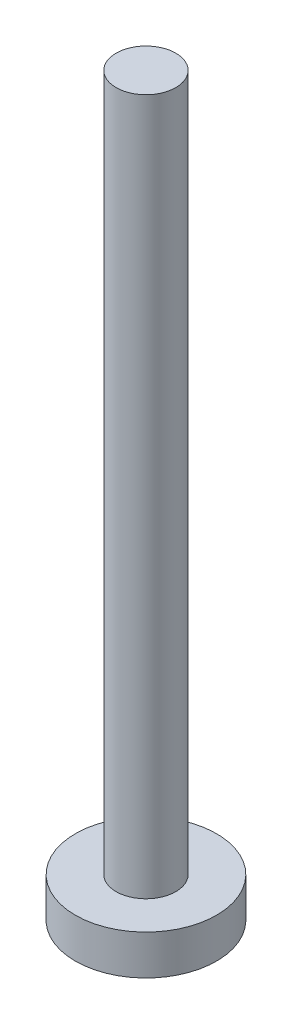
ISO-10303-21;
HEADER;
FILE_DESCRIPTION(('STEP AP214'),'2;1');
FILE_NAME('part.step','',(''),(''),'','','');
FILE_SCHEMA(('AUTOMOTIVE_DESIGN { 1 0 10303 214 1 1 1 1 }'));
ENDSEC;
DATA;
#1=APPLICATION_CONTEXT('core data for automotive mechanical design processes');
#2=APPLICATION_PROTOCOL_DEFINITION('international standard','automotive_design',2000,#1);
#3=PRODUCT_CONTEXT('',#1,'mechanical');
#4=PRODUCT('Part','Part','',(#3));
#5=PRODUCT_RELATED_PRODUCT_CATEGORY('part','',(#4));
#6=PRODUCT_DEFINITION_FORMATION('','',#4);
#7=PRODUCT_DEFINITION_CONTEXT('part definition',#1,'design');
#8=PRODUCT_DEFINITION('design','',#6,#7);
#9=PRODUCT_DEFINITION_SHAPE('','',#8);
#10=(LENGTH_UNIT() NAMED_UNIT(*) SI_UNIT(.MILLI.,.METRE.));
#11=(NAMED_UNIT(*) PLANE_ANGLE_UNIT() SI_UNIT($,.RADIAN.));
#12=(NAMED_UNIT(*) SI_UNIT($,.STERADIAN.) SOLID_ANGLE_UNIT());
#13=UNCERTAINTY_MEASURE_WITH_UNIT(LENGTH_MEASURE(1.E-05),#10,'distance_accuracy_value','');
#14=(GEOMETRIC_REPRESENTATION_CONTEXT(3) GLOBAL_UNCERTAINTY_ASSIGNED_CONTEXT((#13)) GLOBAL_UNIT_ASSIGNED_CONTEXT((#10,
#11,#12)) REPRESENTATION_CONTEXT('',''));
#15=CARTESIAN_POINT('',(0.,0.,0.));
#16=DIRECTION('',(0.,0.,1.));
#17=DIRECTION('',(1.,0.,0.));
#18=AXIS2_PLACEMENT_3D('',#15,#16,#17);
#19=CARTESIAN_POINT('',(0.,2.,0.));
#20=DIRECTION('',(0.,-1.,0.));
#21=DIRECTION('',(0.,0.,-1.));
#22=AXIS2_PLACEMENT_3D('',#19,#20,#21);
#23=CYLINDRICAL_SURFACE('',#22,3.55);
#24=CARTESIAN_POINT('',(0.,2.,0.));
#25=DIRECTION('',(0.,1.,0.));
#26=DIRECTION('',(0.,0.,1.));
#27=AXIS2_PLACEMENT_3D('',#24,#25,#26);
#28=CIRCLE('',#27,3.55);
#29=CARTESIAN_POINT('',(0.,2.,3.55));
#30=VERTEX_POINT('',#29);
#31=EDGE_CURVE('E10',#30,#30,#28,.T.);
#32=ORIENTED_EDGE('',*,*,#31,.F.);
#33=EDGE_LOOP('',(#32));
#34=FACE_BOUND('',#33,.T.);
#35=CARTESIAN_POINT('',(0.,0.,0.));
#36=DIRECTION('',(0.,1.,0.));
#37=DIRECTION('',(0.,0.,1.));
#38=AXIS2_PLACEMENT_3D('',#35,#36,#37);
#39=CIRCLE('',#38,3.55);
#40=CARTESIAN_POINT('',(0.,0.,3.55));
#41=VERTEX_POINT('',#40);
#42=EDGE_CURVE('E38',#41,#41,#39,.T.);
#43=ORIENTED_EDGE('',*,*,#42,.T.);
#44=EDGE_LOOP('',(#43));
#45=FACE_BOUND('',#44,.T.);
#46=ADVANCED_FACE('F35',(#34,#45),#23,.T.);
#47=CARTESIAN_POINT('',(0.,2.,0.));
#48=DIRECTION('',(0.,1.,0.));
#49=DIRECTION('',(0.,0.,1.));
#50=AXIS2_PLACEMENT_3D('',#47,#48,#49);
#51=PLANE('',#50);
#52=CARTESIAN_POINT('',(0.,2.,0.));
#53=DIRECTION('',(0.,1.,0.));
#54=DIRECTION('',(0.,0.,1.));
#55=AXIS2_PLACEMENT_3D('',#52,#53,#54);
#56=CIRCLE('',#55,1.5);
#57=CARTESIAN_POINT('',(0.,2.,1.5));
#58=VERTEX_POINT('',#57);
#59=EDGE_CURVE('E47',#58,#58,#56,.T.);
#60=ORIENTED_EDGE('',*,*,#59,.F.);
#61=EDGE_LOOP('',(#60));
#62=FACE_BOUND('',#61,.T.);
#63=ORIENTED_EDGE('',*,*,#31,.T.);
#64=EDGE_LOOP('',(#63));
#65=FACE_BOUND('',#64,.T.);
#66=ADVANCED_FACE('F62',(#62,#65),#51,.T.);
#67=CARTESIAN_POINT('',(0.,0.,0.));
#68=DIRECTION('',(0.,1.,0.));
#69=DIRECTION('',(0.,0.,1.));
#70=AXIS2_PLACEMENT_3D('',#67,#68,#69);
#71=PLANE('',#70);
#72=ORIENTED_EDGE('',*,*,#42,.F.);
#73=EDGE_LOOP('',(#72));
#74=FACE_BOUND('',#73,.T.);
#75=ADVANCED_FACE('F58',(#74),#71,.F.);
#76=CARTESIAN_POINT('',(0.,37.,0.));
#77=DIRECTION('',(0.,-1.,0.));
#78=DIRECTION('',(0.,0.,-1.));
#79=AXIS2_PLACEMENT_3D('',#76,#77,#78);
#80=CYLINDRICAL_SURFACE('',#79,1.5);
#81=CARTESIAN_POINT('',(0.,37.,0.));
#82=DIRECTION('',(0.,1.,0.));
#83=DIRECTION('',(0.,0.,1.));
#84=AXIS2_PLACEMENT_3D('',#81,#82,#83);
#85=CIRCLE('',#84,1.5);
#86=CARTESIAN_POINT('',(0.,37.,1.5));
#87=VERTEX_POINT('',#86);
#88=EDGE_CURVE('E45',#87,#87,#85,.T.);
#89=ORIENTED_EDGE('',*,*,#88,.F.);
#90=EDGE_LOOP('',(#89));
#91=FACE_BOUND('',#90,.T.);
#92=ORIENTED_EDGE('',*,*,#59,.T.);
#93=EDGE_LOOP('',(#92));
#94=FACE_BOUND('',#93,.T.);
#95=ADVANCED_FACE('F55',(#91,#94),#80,.T.);
#96=CARTESIAN_POINT('',(0.,37.,0.));
#97=DIRECTION('',(0.,1.,0.));
#98=DIRECTION('',(0.,0.,1.));
#99=AXIS2_PLACEMENT_3D('',#96,#97,#98);
#100=PLANE('',#99);
#101=ORIENTED_EDGE('',*,*,#88,.T.);
#102=EDGE_LOOP('',(#101));
#103=FACE_BOUND('',#102,.T.);
#104=ADVANCED_FACE('F53',(#103),#100,.T.);
#105=CLOSED_SHELL('',(#46,#66,#75,#95,#104));
#106=MANIFOLD_SOLID_BREP('B2',#105);
#107=ADVANCED_BREP_SHAPE_REPRESENTATION('',(#18,#106),#14);
#108=SHAPE_DEFINITION_REPRESENTATION(#9,#107);
ENDSEC;
END-ISO-10303-21;
